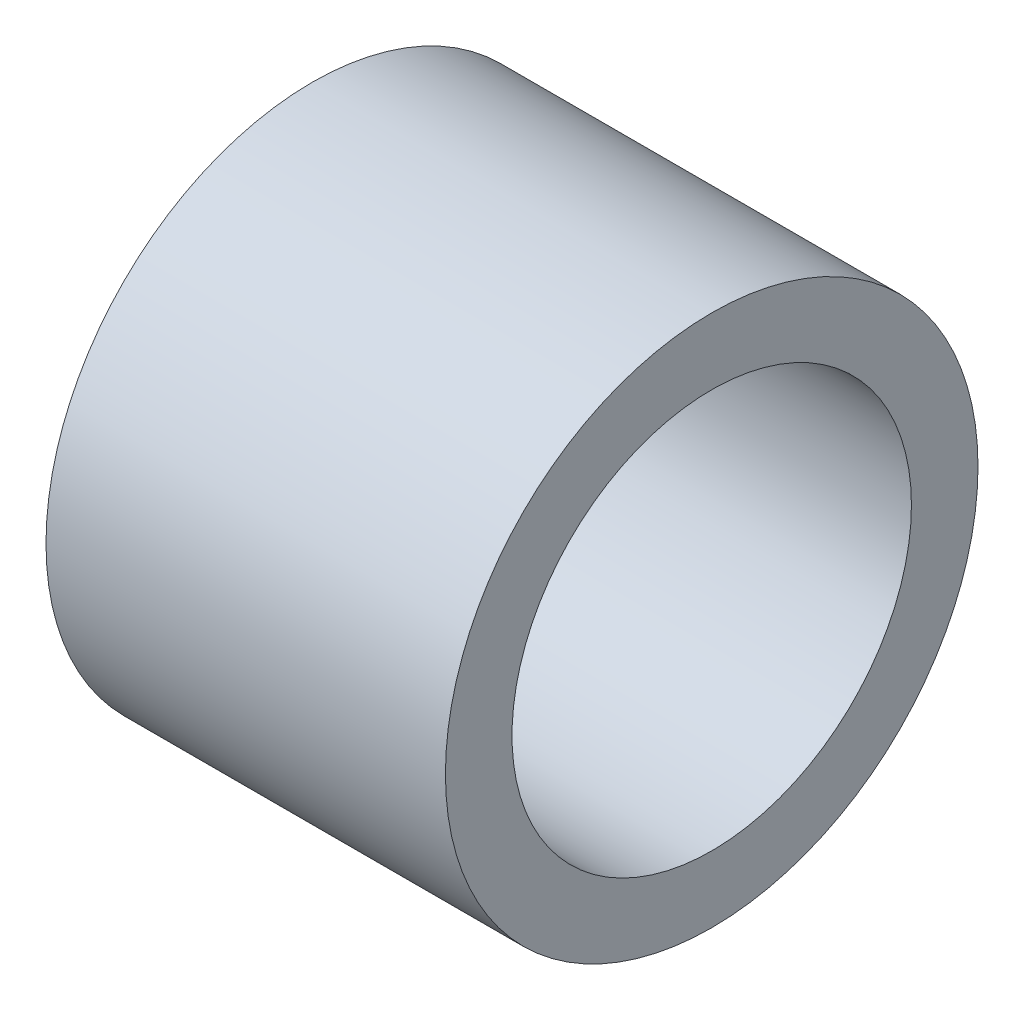
ISO-10303-21;
HEADER;
FILE_DESCRIPTION(('STEP AP214'),'2;1');
FILE_NAME('part.step','',(''),(''),'','','');
FILE_SCHEMA(('AUTOMOTIVE_DESIGN { 1 0 10303 214 1 1 1 1 }'));
ENDSEC;
DATA;
#1=APPLICATION_CONTEXT('core data for automotive mechanical design processes');
#2=APPLICATION_PROTOCOL_DEFINITION('international standard','automotive_design',2000,#1);
#3=PRODUCT_CONTEXT('',#1,'mechanical');
#4=PRODUCT('Part','Part','',(#3));
#5=PRODUCT_RELATED_PRODUCT_CATEGORY('part','',(#4));
#6=PRODUCT_DEFINITION_FORMATION('','',#4);
#7=PRODUCT_DEFINITION_CONTEXT('part definition',#1,'design');
#8=PRODUCT_DEFINITION('design','',#6,#7);
#9=PRODUCT_DEFINITION_SHAPE('','',#8);
#10=(LENGTH_UNIT() NAMED_UNIT(*) SI_UNIT(.MILLI.,.METRE.));
#11=(NAMED_UNIT(*) PLANE_ANGLE_UNIT() SI_UNIT($,.RADIAN.));
#12=(NAMED_UNIT(*) SI_UNIT($,.STERADIAN.) SOLID_ANGLE_UNIT());
#13=UNCERTAINTY_MEASURE_WITH_UNIT(LENGTH_MEASURE(1.E-05),#10,'distance_accuracy_value','');
#14=(GEOMETRIC_REPRESENTATION_CONTEXT(3) GLOBAL_UNCERTAINTY_ASSIGNED_CONTEXT((#13)) GLOBAL_UNIT_ASSIGNED_CONTEXT((#10,
#11,#12)) REPRESENTATION_CONTEXT('',''));
#15=CARTESIAN_POINT('',(0.,0.,0.));
#16=DIRECTION('',(0.,0.,1.));
#17=DIRECTION('',(1.,0.,0.));
#18=AXIS2_PLACEMENT_3D('',#15,#16,#17);
#19=CARTESIAN_POINT('',(9.525,0.,0.));
#20=DIRECTION('',(1.,0.,0.));
#21=DIRECTION('',(0.,0.,-1.));
#22=AXIS2_PLACEMENT_3D('',#19,#20,#21);
#23=PLANE('',#22);
#24=CARTESIAN_POINT('',(9.525,0.,0.));
#25=DIRECTION('',(1.,0.,0.));
#26=DIRECTION('',(0.,0.,-1.));
#27=AXIS2_PLACEMENT_3D('',#24,#25,#26);
#28=CIRCLE('',#27,12.7);
#29=CARTESIAN_POINT('',(9.525,0.,-12.7));
#30=VERTEX_POINT('',#29);
#31=EDGE_CURVE('E10',#30,#30,#28,.T.);
#32=ORIENTED_EDGE('',*,*,#31,.T.);
#33=EDGE_LOOP('',(#32));
#34=FACE_BOUND('',#33,.T.);
#35=CARTESIAN_POINT('',(9.525,0.,0.));
#36=DIRECTION('',(1.,0.,0.));
#37=DIRECTION('',(0.,0.,-1.));
#38=AXIS2_PLACEMENT_3D('',#35,#36,#37);
#39=CIRCLE('',#38,9.525);
#40=CARTESIAN_POINT('',(9.525,0.,-9.525));
#41=VERTEX_POINT('',#40);
#42=EDGE_CURVE('E42',#41,#41,#39,.T.);
#43=ORIENTED_EDGE('',*,*,#42,.F.);
#44=EDGE_LOOP('',(#43));
#45=FACE_BOUND('',#44,.T.);
#46=ADVANCED_FACE('F31',(#34,#45),#23,.T.);
#47=CARTESIAN_POINT('',(-9.525,0.,0.));
#48=DIRECTION('',(1.,0.,0.));
#49=DIRECTION('',(0.,0.,-1.));
#50=AXIS2_PLACEMENT_3D('',#47,#48,#49);
#51=PLANE('',#50);
#52=CARTESIAN_POINT('',(-9.525,0.,0.));
#53=DIRECTION('',(1.,0.,0.));
#54=DIRECTION('',(0.,0.,-1.));
#55=AXIS2_PLACEMENT_3D('',#52,#53,#54);
#56=CIRCLE('',#55,12.7);
#57=CARTESIAN_POINT('',(-9.525,0.,-12.7));
#58=VERTEX_POINT('',#57);
#59=EDGE_CURVE('E35',#58,#58,#56,.T.);
#60=ORIENTED_EDGE('',*,*,#59,.F.);
#61=EDGE_LOOP('',(#60));
#62=FACE_BOUND('',#61,.T.);
#63=CARTESIAN_POINT('',(-9.525,0.,0.));
#64=DIRECTION('',(1.,0.,0.));
#65=DIRECTION('',(0.,0.,-1.));
#66=AXIS2_PLACEMENT_3D('',#63,#64,#65);
#67=CIRCLE('',#66,9.525);
#68=CARTESIAN_POINT('',(-9.525,0.,-9.525));
#69=VERTEX_POINT('',#68);
#70=EDGE_CURVE('E44',#69,#69,#67,.T.);
#71=ORIENTED_EDGE('',*,*,#70,.T.);
#72=EDGE_LOOP('',(#71));
#73=FACE_BOUND('',#72,.T.);
#74=ADVANCED_FACE('F54',(#62,#73),#51,.F.);
#75=CARTESIAN_POINT('',(9.525,0.,0.));
#76=DIRECTION('',(-1.,0.,0.));
#77=DIRECTION('',(0.,0.,1.));
#78=AXIS2_PLACEMENT_3D('',#75,#76,#77);
#79=CYLINDRICAL_SURFACE('',#78,12.7);
#80=ORIENTED_EDGE('',*,*,#31,.F.);
#81=EDGE_LOOP('',(#80));
#82=FACE_BOUND('',#81,.T.);
#83=ORIENTED_EDGE('',*,*,#59,.T.);
#84=EDGE_LOOP('',(#83));
#85=FACE_BOUND('',#84,.T.);
#86=ADVANCED_FACE('F33',(#82,#85),#79,.T.);
#87=CARTESIAN_POINT('',(9.525,0.,0.));
#88=DIRECTION('',(-1.,0.,0.));
#89=DIRECTION('',(0.,0.,1.));
#90=AXIS2_PLACEMENT_3D('',#87,#88,#89);
#91=CYLINDRICAL_SURFACE('',#90,9.525);
#92=ORIENTED_EDGE('',*,*,#42,.T.);
#93=EDGE_LOOP('',(#92));
#94=FACE_BOUND('',#93,.T.);
#95=ORIENTED_EDGE('',*,*,#70,.F.);
#96=EDGE_LOOP('',(#95));
#97=FACE_BOUND('',#96,.T.);
#98=ADVANCED_FACE('F50',(#94,#97),#91,.F.);
#99=CLOSED_SHELL('',(#46,#74,#86,#98));
#100=MANIFOLD_SOLID_BREP('B2',#99);
#101=ADVANCED_BREP_SHAPE_REPRESENTATION('',(#18,#100),#14);
#102=SHAPE_DEFINITION_REPRESENTATION(#9,#101);
ENDSEC;
END-ISO-10303-21;
